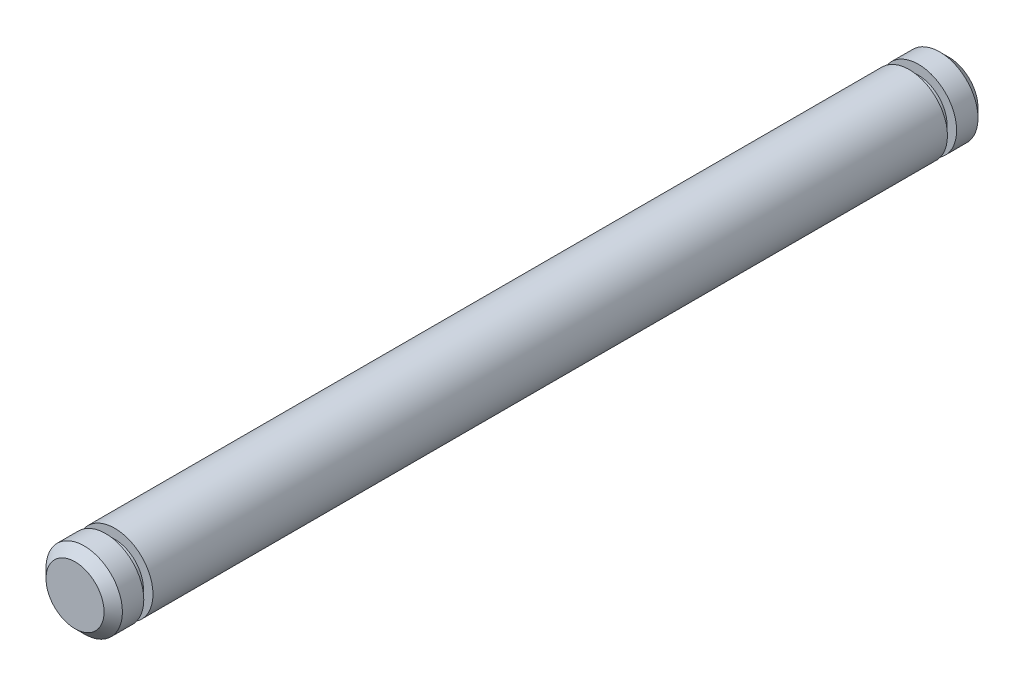
ISO-10303-21;
HEADER;
FILE_DESCRIPTION(('STEP AP214'),'2;1');
FILE_NAME('part.step','',(''),(''),'','','');
FILE_SCHEMA(('AUTOMOTIVE_DESIGN { 1 0 10303 214 1 1 1 1 }'));
ENDSEC;
DATA;
#1=APPLICATION_CONTEXT('core data for automotive mechanical design processes');
#2=APPLICATION_PROTOCOL_DEFINITION('international standard','automotive_design',2000,#1);
#3=PRODUCT_CONTEXT('',#1,'mechanical');
#4=PRODUCT('Part','Part','',(#3));
#5=PRODUCT_RELATED_PRODUCT_CATEGORY('part','',(#4));
#6=PRODUCT_DEFINITION_FORMATION('','',#4);
#7=PRODUCT_DEFINITION_CONTEXT('part definition',#1,'design');
#8=PRODUCT_DEFINITION('design','',#6,#7);
#9=PRODUCT_DEFINITION_SHAPE('','',#8);
#10=(LENGTH_UNIT() NAMED_UNIT(*) SI_UNIT(.MILLI.,.METRE.));
#11=(NAMED_UNIT(*) PLANE_ANGLE_UNIT() SI_UNIT($,.RADIAN.));
#12=(NAMED_UNIT(*) SI_UNIT($,.STERADIAN.) SOLID_ANGLE_UNIT());
#13=UNCERTAINTY_MEASURE_WITH_UNIT(LENGTH_MEASURE(1.E-05),#10,'distance_accuracy_value','');
#14=(GEOMETRIC_REPRESENTATION_CONTEXT(3) GLOBAL_UNCERTAINTY_ASSIGNED_CONTEXT((#13)) GLOBAL_UNIT_ASSIGNED_CONTEXT((#10,
#11,#12)) REPRESENTATION_CONTEXT('',''));
#15=CARTESIAN_POINT('',(0.,0.,0.));
#16=DIRECTION('',(0.,0.,1.));
#17=DIRECTION('',(1.,0.,0.));
#18=AXIS2_PLACEMENT_3D('',#15,#16,#17);
#19=CARTESIAN_POINT('',(0.,0.,16.50746));
#20=DIRECTION('',(0.,0.,-1.));
#21=DIRECTION('',(-1.,0.,0.));
#22=AXIS2_PLACEMENT_3D('',#19,#20,#21);
#23=CYLINDRICAL_SURFACE('',#22,1.5875);
#24=CARTESIAN_POINT('',(0.,0.,16.50746));
#25=DIRECTION('',(0.,0.,1.));
#26=DIRECTION('',(1.,0.,0.));
#27=AXIS2_PLACEMENT_3D('',#24,#25,#26);
#28=CIRCLE('',#27,1.5875);
#29=CARTESIAN_POINT('',(1.5875,0.,16.50746));
#30=VERTEX_POINT('',#29);
#31=EDGE_CURVE('E55',#30,#30,#28,.T.);
#32=ORIENTED_EDGE('',*,*,#31,.F.);
#33=EDGE_LOOP('',(#32));
#34=FACE_BOUND('',#33,.T.);
#35=CARTESIAN_POINT('',(0.,0.,-16.50746));
#36=DIRECTION('',(0.,0.,1.));
#37=DIRECTION('',(1.,0.,0.));
#38=AXIS2_PLACEMENT_3D('',#35,#36,#37);
#39=CIRCLE('',#38,1.5875);
#40=CARTESIAN_POINT('',(1.5875,0.,-16.50746));
#41=VERTEX_POINT('',#40);
#42=EDGE_CURVE('E52',#41,#41,#39,.T.);
#43=ORIENTED_EDGE('',*,*,#42,.T.);
#44=EDGE_LOOP('',(#43));
#45=FACE_BOUND('',#44,.T.);
#46=ADVANCED_FACE('F31',(#34,#45),#23,.T.);
#47=CARTESIAN_POINT('',(0.,0.,16.50746));
#48=DIRECTION('',(0.,0.,1.));
#49=DIRECTION('',(1.,0.,0.));
#50=AXIS2_PLACEMENT_3D('',#47,#48,#49);
#51=PLANE('',#50);
#52=CARTESIAN_POINT('',(0.,0.,16.50746));
#53=DIRECTION('',(0.,0.,1.));
#54=DIRECTION('',(1.,0.,0.));
#55=AXIS2_PLACEMENT_3D('',#52,#53,#54);
#56=CIRCLE('',#55,1.19126);
#57=CARTESIAN_POINT('',(1.19126,0.,16.50746));
#58=VERTEX_POINT('',#57);
#59=EDGE_CURVE('E51',#58,#58,#56,.T.);
#60=ORIENTED_EDGE('',*,*,#59,.F.);
#61=EDGE_LOOP('',(#60));
#62=FACE_BOUND('',#61,.T.);
#63=ORIENTED_EDGE('',*,*,#31,.T.);
#64=EDGE_LOOP('',(#63));
#65=FACE_BOUND('',#64,.T.);
#66=ADVANCED_FACE('F93',(#62,#65),#51,.T.);
#67=CARTESIAN_POINT('',(0.,0.,-16.50746));
#68=DIRECTION('',(0.,0.,1.));
#69=DIRECTION('',(1.,0.,0.));
#70=AXIS2_PLACEMENT_3D('',#67,#68,#69);
#71=PLANE('',#70);
#72=CARTESIAN_POINT('',(0.,0.,-16.50746));
#73=DIRECTION('',(0.,0.,1.));
#74=DIRECTION('',(1.,0.,0.));
#75=AXIS2_PLACEMENT_3D('',#72,#73,#74);
#76=CIRCLE('',#75,1.19126);
#77=CARTESIAN_POINT('',(1.19126,0.,-16.50746));
#78=VERTEX_POINT('',#77);
#79=EDGE_CURVE('E66',#78,#78,#76,.T.);
#80=ORIENTED_EDGE('',*,*,#79,.T.);
#81=EDGE_LOOP('',(#80));
#82=FACE_BOUND('',#81,.T.);
#83=ORIENTED_EDGE('',*,*,#42,.F.);
#84=EDGE_LOOP('',(#83));
#85=FACE_BOUND('',#84,.T.);
#86=ADVANCED_FACE('F99',(#82,#85),#71,.F.);
#87=CARTESIAN_POINT('',(0.,0.,16.88846));
#88=DIRECTION('',(0.,0.,-1.));
#89=DIRECTION('',(-1.,0.,0.));
#90=AXIS2_PLACEMENT_3D('',#87,#88,#89);
#91=CYLINDRICAL_SURFACE('',#90,1.19126);
#92=CARTESIAN_POINT('',(0.,0.,16.88846));
#93=DIRECTION('',(0.,0.,1.));
#94=DIRECTION('',(1.,0.,0.));
#95=AXIS2_PLACEMENT_3D('',#92,#93,#94);
#96=CIRCLE('',#95,1.19126);
#97=CARTESIAN_POINT('',(1.19126,0.,16.88846));
#98=VERTEX_POINT('',#97);
#99=EDGE_CURVE('E56',#98,#98,#96,.T.);
#100=ORIENTED_EDGE('',*,*,#99,.F.);
#101=EDGE_LOOP('',(#100));
#102=FACE_BOUND('',#101,.T.);
#103=ORIENTED_EDGE('',*,*,#59,.T.);
#104=EDGE_LOOP('',(#103));
#105=FACE_BOUND('',#104,.T.);
#106=ADVANCED_FACE('F124',(#102,#105),#91,.T.);
#107=CARTESIAN_POINT('',(0.,0.,18.15846));
#108=DIRECTION('',(0.,0.,-1.));
#109=DIRECTION('',(-1.,0.,0.));
#110=AXIS2_PLACEMENT_3D('',#107,#108,#109);
#111=CYLINDRICAL_SURFACE('',#110,1.5875);
#112=CARTESIAN_POINT('',(0.,0.,17.77746));
#113=DIRECTION('',(0.,0.,1.));
#114=DIRECTION('',(1.,0.,0.));
#115=AXIS2_PLACEMENT_3D('',#112,#113,#114);
#116=CIRCLE('',#115,1.5875);
#117=CARTESIAN_POINT('',(1.5875,0.,17.77746));
#118=VERTEX_POINT('',#117);
#119=EDGE_CURVE('E42',#118,#118,#116,.F.);
#120=ORIENTED_EDGE('',*,*,#119,.T.);
#121=EDGE_LOOP('',(#120));
#122=FACE_BOUND('',#121,.T.);
#123=CARTESIAN_POINT('',(0.,0.,16.88846));
#124=DIRECTION('',(0.,0.,1.));
#125=DIRECTION('',(1.,0.,0.));
#126=AXIS2_PLACEMENT_3D('',#123,#124,#125);
#127=CIRCLE('',#126,1.5875);
#128=CARTESIAN_POINT('',(1.5875,0.,16.88846));
#129=VERTEX_POINT('',#128);
#130=EDGE_CURVE('E63',#129,#129,#127,.T.);
#131=ORIENTED_EDGE('',*,*,#130,.T.);
#132=EDGE_LOOP('',(#131));
#133=FACE_BOUND('',#132,.T.);
#134=ADVANCED_FACE('F119',(#122,#133),#111,.T.);
#135=CARTESIAN_POINT('',(0.,0.,18.15846));
#136=DIRECTION('',(0.,0.,1.));
#137=DIRECTION('',(1.,0.,0.));
#138=AXIS2_PLACEMENT_3D('',#135,#136,#137);
#139=PLANE('',#138);
#140=CARTESIAN_POINT('',(0.,0.,18.15846));
#141=DIRECTION('',(0.,0.,1.));
#142=DIRECTION('',(1.,0.,0.));
#143=AXIS2_PLACEMENT_3D('',#140,#141,#142);
#144=CIRCLE('',#143,1.2065);
#145=CARTESIAN_POINT('',(1.2065,0.,18.15846));
#146=VERTEX_POINT('',#145);
#147=EDGE_CURVE('E46',#146,#146,#144,.T.);
#148=ORIENTED_EDGE('',*,*,#147,.T.);
#149=EDGE_LOOP('',(#148));
#150=FACE_BOUND('',#149,.T.);
#151=ADVANCED_FACE('F111',(#150),#139,.T.);
#152=CARTESIAN_POINT('',(0.,0.,16.88846));
#153=DIRECTION('',(0.,0.,1.));
#154=DIRECTION('',(1.,0.,0.));
#155=AXIS2_PLACEMENT_3D('',#152,#153,#154);
#156=PLANE('',#155);
#157=ORIENTED_EDGE('',*,*,#99,.T.);
#158=EDGE_LOOP('',(#157));
#159=FACE_BOUND('',#158,.T.);
#160=ORIENTED_EDGE('',*,*,#130,.F.);
#161=EDGE_LOOP('',(#160));
#162=FACE_BOUND('',#161,.T.);
#163=ADVANCED_FACE('F106',(#159,#162),#156,.F.);
#164=CARTESIAN_POINT('',(0.,0.,18.15846));
#165=DIRECTION('',(0.,0.,-1.));
#166=DIRECTION('',(-1.,0.,0.));
#167=AXIS2_PLACEMENT_3D('',#164,#165,#166);
#168=CONICAL_SURFACE('',#167,1.2065,0.785398163397446);
#169=ORIENTED_EDGE('',*,*,#119,.F.);
#170=EDGE_LOOP('',(#169));
#171=FACE_BOUND('',#170,.T.);
#172=ORIENTED_EDGE('',*,*,#147,.F.);
#173=EDGE_LOOP('',(#172));
#174=FACE_BOUND('',#173,.T.);
#175=ADVANCED_FACE('F88',(#171,#174),#168,.T.);
#176=CARTESIAN_POINT('',(0.,0.,-16.88846));
#177=DIRECTION('',(0.,0.,1.));
#178=DIRECTION('',(1.,0.,0.));
#179=AXIS2_PLACEMENT_3D('',#176,#177,#178);
#180=CYLINDRICAL_SURFACE('',#179,1.19126);
#181=CARTESIAN_POINT('',(0.,0.,-16.88846));
#182=DIRECTION('',(0.,0.,1.));
#183=DIRECTION('',(1.,0.,0.));
#184=AXIS2_PLACEMENT_3D('',#181,#182,#183);
#185=CIRCLE('',#184,1.19126);
#186=CARTESIAN_POINT('',(1.19126,0.,-16.88846));
#187=VERTEX_POINT('',#186);
#188=EDGE_CURVE('E69',#187,#187,#185,.T.);
#189=ORIENTED_EDGE('',*,*,#188,.T.);
#190=EDGE_LOOP('',(#189));
#191=FACE_BOUND('',#190,.T.);
#192=ORIENTED_EDGE('',*,*,#79,.F.);
#193=EDGE_LOOP('',(#192));
#194=FACE_BOUND('',#193,.T.);
#195=ADVANCED_FACE('F81',(#191,#194),#180,.T.);
#196=CARTESIAN_POINT('',(0.,0.,-18.15846));
#197=DIRECTION('',(0.,0.,1.));
#198=DIRECTION('',(1.,0.,0.));
#199=AXIS2_PLACEMENT_3D('',#196,#197,#198);
#200=CYLINDRICAL_SURFACE('',#199,1.5875);
#201=CARTESIAN_POINT('',(0.,0.,-17.77746));
#202=DIRECTION('',(0.,0.,-1.));
#203=DIRECTION('',(-1.,0.,0.));
#204=AXIS2_PLACEMENT_3D('',#201,#202,#203);
#205=CIRCLE('',#204,1.5875);
#206=CARTESIAN_POINT('',(-1.5875,0.,-17.77746));
#207=VERTEX_POINT('',#206);
#208=EDGE_CURVE('E38',#207,#207,#205,.F.);
#209=ORIENTED_EDGE('',*,*,#208,.T.);
#210=EDGE_LOOP('',(#209));
#211=FACE_BOUND('',#210,.T.);
#212=CARTESIAN_POINT('',(0.,0.,-16.88846));
#213=DIRECTION('',(0.,0.,1.));
#214=DIRECTION('',(1.,0.,0.));
#215=AXIS2_PLACEMENT_3D('',#212,#213,#214);
#216=CIRCLE('',#215,1.5875);
#217=CARTESIAN_POINT('',(1.5875,0.,-16.88846));
#218=VERTEX_POINT('',#217);
#219=EDGE_CURVE('E72',#218,#218,#216,.T.);
#220=ORIENTED_EDGE('',*,*,#219,.F.);
#221=EDGE_LOOP('',(#220));
#222=FACE_BOUND('',#221,.T.);
#223=ADVANCED_FACE('F78',(#211,#222),#200,.T.);
#224=CARTESIAN_POINT('',(0.,0.,-18.15846));
#225=DIRECTION('',(0.,0.,-1.));
#226=DIRECTION('',(1.,0.,0.));
#227=AXIS2_PLACEMENT_3D('',#224,#225,#226);
#228=PLANE('',#227);
#229=CARTESIAN_POINT('',(0.,0.,-18.15846));
#230=DIRECTION('',(0.,0.,-1.));
#231=DIRECTION('',(-1.,0.,0.));
#232=AXIS2_PLACEMENT_3D('',#229,#230,#231);
#233=CIRCLE('',#232,1.2065);
#234=CARTESIAN_POINT('',(-1.2065,0.,-18.15846));
#235=VERTEX_POINT('',#234);
#236=EDGE_CURVE('E10',#235,#235,#233,.T.);
#237=ORIENTED_EDGE('',*,*,#236,.T.);
#238=EDGE_LOOP('',(#237));
#239=FACE_BOUND('',#238,.T.);
#240=ADVANCED_FACE('F80',(#239),#228,.T.);
#241=CARTESIAN_POINT('',(0.,0.,-16.88846));
#242=DIRECTION('',(0.,0.,-1.));
#243=DIRECTION('',(1.,0.,0.));
#244=AXIS2_PLACEMENT_3D('',#241,#242,#243);
#245=PLANE('',#244);
#246=ORIENTED_EDGE('',*,*,#188,.F.);
#247=EDGE_LOOP('',(#246));
#248=FACE_BOUND('',#247,.T.);
#249=ORIENTED_EDGE('',*,*,#219,.T.);
#250=EDGE_LOOP('',(#249));
#251=FACE_BOUND('',#250,.T.);
#252=ADVANCED_FACE('F76',(#248,#251),#245,.F.);
#253=CARTESIAN_POINT('',(0.,0.,-17.77746));
#254=DIRECTION('',(0.,0.,1.));
#255=DIRECTION('',(1.,0.,0.));
#256=AXIS2_PLACEMENT_3D('',#253,#254,#255);
#257=CONICAL_SURFACE('',#256,1.5875,0.78539816339745);
#258=ORIENTED_EDGE('',*,*,#236,.F.);
#259=EDGE_LOOP('',(#258));
#260=FACE_BOUND('',#259,.T.);
#261=ORIENTED_EDGE('',*,*,#208,.F.);
#262=EDGE_LOOP('',(#261));
#263=FACE_BOUND('',#262,.T.);
#264=ADVANCED_FACE('F33',(#260,#263),#257,.T.);
#265=CLOSED_SHELL('',(#46,#66,#86,#106,#134,#151,#163,#175,#195,#223,#240,#252,#264));
#266=MANIFOLD_SOLID_BREP('B2',#265);
#267=ADVANCED_BREP_SHAPE_REPRESENTATION('',(#18,#266),#14);
#268=SHAPE_DEFINITION_REPRESENTATION(#9,#267);
ENDSEC;
END-ISO-10303-21;
